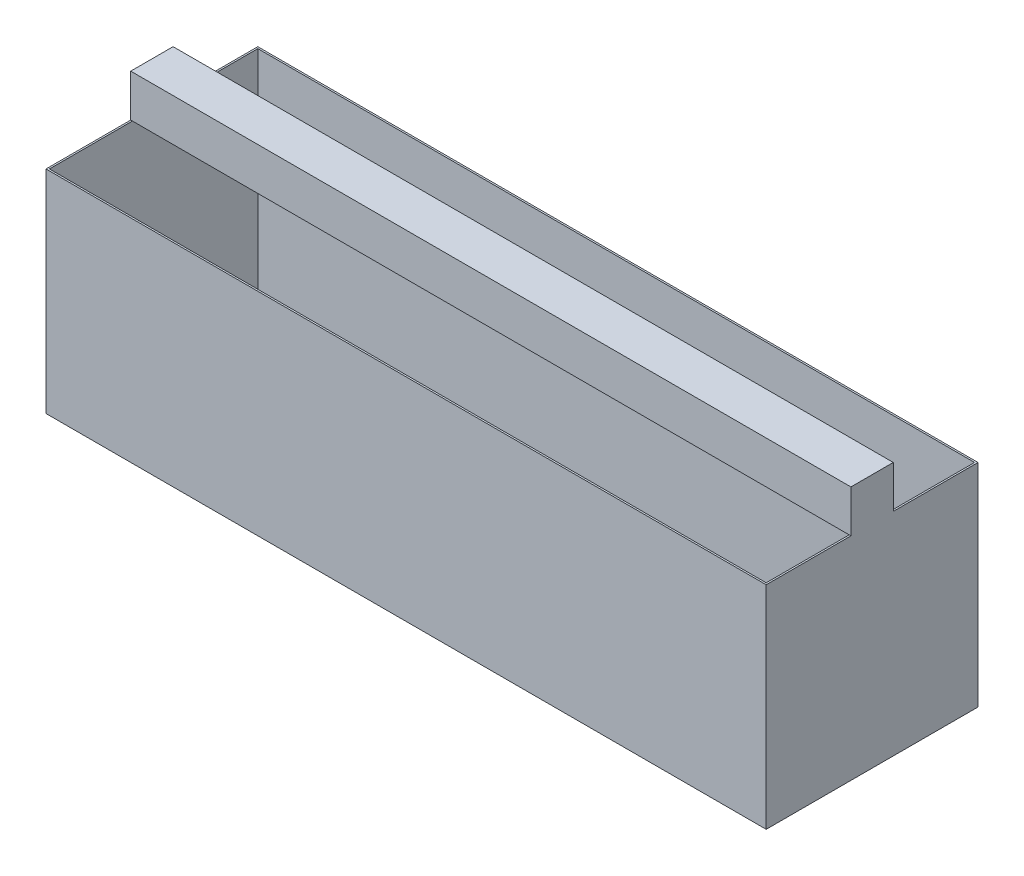
ISO-10303-21;
HEADER;
FILE_DESCRIPTION(('STEP AP214'),'2;1');
FILE_NAME('part.step','',(''),(''),'','','');
FILE_SCHEMA(('AUTOMOTIVE_DESIGN { 1 0 10303 214 1 1 1 1 }'));
ENDSEC;
DATA;
#1=APPLICATION_CONTEXT('core data for automotive mechanical design processes');
#2=APPLICATION_PROTOCOL_DEFINITION('international standard','automotive_design',2000,#1);
#3=PRODUCT_CONTEXT('',#1,'mechanical');
#4=PRODUCT('Part','Part','',(#3));
#5=PRODUCT_RELATED_PRODUCT_CATEGORY('part','',(#4));
#6=PRODUCT_DEFINITION_FORMATION('','',#4);
#7=PRODUCT_DEFINITION_CONTEXT('part definition',#1,'design');
#8=PRODUCT_DEFINITION('design','',#6,#7);
#9=PRODUCT_DEFINITION_SHAPE('','',#8);
#10=(LENGTH_UNIT() NAMED_UNIT(*) SI_UNIT(.MILLI.,.METRE.));
#11=(NAMED_UNIT(*) PLANE_ANGLE_UNIT() SI_UNIT($,.RADIAN.));
#12=(NAMED_UNIT(*) SI_UNIT($,.STERADIAN.) SOLID_ANGLE_UNIT());
#13=UNCERTAINTY_MEASURE_WITH_UNIT(LENGTH_MEASURE(1.E-05),#10,'distance_accuracy_value','');
#14=(GEOMETRIC_REPRESENTATION_CONTEXT(3) GLOBAL_UNCERTAINTY_ASSIGNED_CONTEXT((#13)) GLOBAL_UNIT_ASSIGNED_CONTEXT((#10,
#11,#12)) REPRESENTATION_CONTEXT('',''));
#15=CARTESIAN_POINT('',(0.,0.,0.));
#16=DIRECTION('',(0.,0.,1.));
#17=DIRECTION('',(1.,0.,0.));
#18=AXIS2_PLACEMENT_3D('',#15,#16,#17);
#19=CARTESIAN_POINT('',(0.,500.,500.));
#20=DIRECTION('',(0.,1.,0.));
#21=DIRECTION('',(0.,0.,1.));
#22=AXIS2_PLACEMENT_3D('',#19,#20,#21);
#23=PLANE('',#22);
#24=DIRECTION('',(0.,0.,-1.));
#25=VECTOR('',#24,1.);
#26=CARTESIAN_POINT('',(0.,500.,500.));
#27=LINE('',#26,#25);
#28=CARTESIAN_POINT('',(0.,500.,200.));
#29=VERTEX_POINT('',#28);
#30=CARTESIAN_POINT('',(0.,500.,0.));
#31=VERTEX_POINT('',#30);
#32=EDGE_CURVE('E146',#29,#31,#27,.T.);
#33=ORIENTED_EDGE('',*,*,#32,.F.);
#34=DIRECTION('',(1.,0.,0.));
#35=VECTOR('',#34,1.);
#36=CARTESIAN_POINT('',(-141.42135623731,500.,200.));
#37=LINE('',#36,#35);
#38=CARTESIAN_POINT('',(4.,500.,200.));
#39=VERTEX_POINT('',#38);
#40=EDGE_CURVE('E155',#29,#39,#37,.T.);
#41=ORIENTED_EDGE('',*,*,#40,.T.);
#42=DIRECTION('',(0.,0.,-1.));
#43=VECTOR('',#42,1.);
#44=CARTESIAN_POINT('',(4.,500.,500.));
#45=LINE('',#44,#43);
#46=CARTESIAN_POINT('',(4.,500.,4.));
#47=VERTEX_POINT('',#46);
#48=EDGE_CURVE('E251',#39,#47,#45,.T.);
#49=ORIENTED_EDGE('',*,*,#48,.T.);
#50=DIRECTION('',(1.,0.,0.));
#51=VECTOR('',#50,1.);
#52=CARTESIAN_POINT('',(0.,500.,4.));
#53=LINE('',#52,#51);
#54=CARTESIAN_POINT('',(1696.,500.,4.));
#55=VERTEX_POINT('',#54);
#56=EDGE_CURVE('E228',#47,#55,#53,.T.);
#57=ORIENTED_EDGE('',*,*,#56,.T.);
#58=DIRECTION('',(0.,0.,-1.));
#59=VECTOR('',#58,1.);
#60=CARTESIAN_POINT('',(1696.,500.,500.));
#61=LINE('',#60,#59);
#62=CARTESIAN_POINT('',(1696.,500.,200.));
#63=VERTEX_POINT('',#62);
#64=EDGE_CURVE('E240',#63,#55,#61,.T.);
#65=ORIENTED_EDGE('',*,*,#64,.F.);
#66=CARTESIAN_POINT('',(1700.,500.,200.));
#67=VERTEX_POINT('',#66);
#68=EDGE_CURVE('E49',#63,#67,#37,.T.);
#69=ORIENTED_EDGE('',*,*,#68,.T.);
#70=DIRECTION('',(0.,0.,-1.));
#71=VECTOR('',#70,1.);
#72=CARTESIAN_POINT('',(1700.,500.,500.));
#73=LINE('',#72,#71);
#74=CARTESIAN_POINT('',(1700.,500.,0.));
#75=VERTEX_POINT('',#74);
#76=EDGE_CURVE('E170',#67,#75,#73,.T.);
#77=ORIENTED_EDGE('',*,*,#76,.T.);
#78=DIRECTION('',(1.,0.,0.));
#79=VECTOR('',#78,1.);
#80=CARTESIAN_POINT('',(0.,500.,0.));
#81=LINE('',#80,#79);
#82=EDGE_CURVE('E163',#31,#75,#81,.T.);
#83=ORIENTED_EDGE('',*,*,#82,.F.);
#84=EDGE_LOOP('',(#33,#41,#49,#57,#65,#69,#77,#83));
#85=FACE_BOUND('',#84,.T.);
#86=ADVANCED_FACE('F39',(#85),#23,.T.);
#87=DIRECTION('',(1.,0.,0.));
#88=VECTOR('',#87,1.);
#89=CARTESIAN_POINT('',(-141.42135623731,500.,300.));
#90=LINE('',#89,#88);
#91=CARTESIAN_POINT('',(0.,500.,300.));
#92=VERTEX_POINT('',#91);
#93=CARTESIAN_POINT('',(4.,500.,300.));
#94=VERTEX_POINT('',#93);
#95=EDGE_CURVE('E51',#92,#94,#90,.T.);
#96=ORIENTED_EDGE('',*,*,#95,.F.);
#97=CARTESIAN_POINT('',(0.,500.,500.));
#98=VERTEX_POINT('',#97);
#99=EDGE_CURVE('E43',#98,#92,#27,.T.);
#100=ORIENTED_EDGE('',*,*,#99,.F.);
#101=DIRECTION('',(1.,0.,0.));
#102=VECTOR('',#101,1.);
#103=CARTESIAN_POINT('',(0.,500.,500.));
#104=LINE('',#103,#102);
#105=CARTESIAN_POINT('',(1700.,500.,500.));
#106=VERTEX_POINT('',#105);
#107=EDGE_CURVE('E178',#98,#106,#104,.T.);
#108=ORIENTED_EDGE('',*,*,#107,.T.);
#109=CARTESIAN_POINT('',(1700.,500.,300.));
#110=VERTEX_POINT('',#109);
#111=EDGE_CURVE('E202',#106,#110,#73,.T.);
#112=ORIENTED_EDGE('',*,*,#111,.T.);
#113=CARTESIAN_POINT('',(1696.,500.,300.));
#114=VERTEX_POINT('',#113);
#115=EDGE_CURVE('E11',#114,#110,#90,.T.);
#116=ORIENTED_EDGE('',*,*,#115,.F.);
#117=CARTESIAN_POINT('',(1696.,500.,496.));
#118=VERTEX_POINT('',#117);
#119=EDGE_CURVE('E234',#118,#114,#61,.T.);
#120=ORIENTED_EDGE('',*,*,#119,.F.);
#121=DIRECTION('',(1.,0.,0.));
#122=VECTOR('',#121,1.);
#123=CARTESIAN_POINT('',(0.,500.,496.));
#124=LINE('',#123,#122);
#125=CARTESIAN_POINT('',(4.,500.,496.));
#126=VERTEX_POINT('',#125);
#127=EDGE_CURVE('E241',#126,#118,#124,.T.);
#128=ORIENTED_EDGE('',*,*,#127,.F.);
#129=EDGE_CURVE('E246',#126,#94,#45,.T.);
#130=ORIENTED_EDGE('',*,*,#129,.T.);
#131=EDGE_LOOP('',(#96,#100,#108,#112,#116,#120,#128,#130));
#132=FACE_BOUND('',#131,.T.);
#133=ADVANCED_FACE('F305',(#132),#23,.T.);
#134=CARTESIAN_POINT('',(0.,0.,500.));
#135=DIRECTION('',(-1.,0.,0.));
#136=DIRECTION('',(0.,0.,1.));
#137=AXIS2_PLACEMENT_3D('',#134,#135,#136);
#138=PLANE('',#137);
#139=DIRECTION('',(0.,1.,0.));
#140=VECTOR('',#139,1.);
#141=CARTESIAN_POINT('',(0.,0.,0.));
#142=LINE('',#141,#140);
#143=CARTESIAN_POINT('',(0.,0.,0.));
#144=VERTEX_POINT('',#143);
#145=EDGE_CURVE('E182',#144,#31,#142,.T.);
#146=ORIENTED_EDGE('',*,*,#145,.F.);
#147=DIRECTION('',(0.,0.,-1.));
#148=VECTOR('',#147,1.);
#149=CARTESIAN_POINT('',(0.,0.,500.));
#150=LINE('',#149,#148);
#151=CARTESIAN_POINT('',(0.,0.,500.));
#152=VERTEX_POINT('',#151);
#153=EDGE_CURVE('E196',#152,#144,#150,.T.);
#154=ORIENTED_EDGE('',*,*,#153,.F.);
#155=DIRECTION('',(0.,1.,0.));
#156=VECTOR('',#155,1.);
#157=CARTESIAN_POINT('',(0.,0.,500.));
#158=LINE('',#157,#156);
#159=EDGE_CURVE('E195',#152,#98,#158,.T.);
#160=ORIENTED_EDGE('',*,*,#159,.T.);
#161=ORIENTED_EDGE('',*,*,#99,.T.);
#162=DIRECTION('',(0.,-1.,0.));
#163=VECTOR('',#162,1.);
#164=CARTESIAN_POINT('',(0.,600.,300.));
#165=LINE('',#164,#163);
#166=CARTESIAN_POINT('',(0.,600.,300.));
#167=VERTEX_POINT('',#166);
#168=EDGE_CURVE('E285',#167,#92,#165,.T.);
#169=ORIENTED_EDGE('',*,*,#168,.F.);
#170=DIRECTION('',(0.,0.,-1.));
#171=VECTOR('',#170,1.);
#172=CARTESIAN_POINT('',(0.,600.,300.));
#173=LINE('',#172,#171);
#174=CARTESIAN_POINT('',(0.,600.,200.));
#175=VERTEX_POINT('',#174);
#176=EDGE_CURVE('E149',#167,#175,#173,.T.);
#177=ORIENTED_EDGE('',*,*,#176,.T.);
#178=DIRECTION('',(0.,-1.,0.));
#179=VECTOR('',#178,1.);
#180=CARTESIAN_POINT('',(0.,600.,200.));
#181=LINE('',#180,#179);
#182=EDGE_CURVE('E143',#175,#29,#181,.T.);
#183=ORIENTED_EDGE('',*,*,#182,.T.);
#184=ORIENTED_EDGE('',*,*,#32,.T.);
#185=EDGE_LOOP('',(#146,#154,#160,#161,#169,#177,#183,#184));
#186=FACE_BOUND('',#185,.T.);
#187=ADVANCED_FACE('F41',(#186),#138,.T.);
#188=CARTESIAN_POINT('',(0.,0.,500.));
#189=DIRECTION('',(0.,1.,0.));
#190=DIRECTION('',(0.,0.,1.));
#191=AXIS2_PLACEMENT_3D('',#188,#189,#190);
#192=PLANE('',#191);
#193=DIRECTION('',(1.,0.,0.));
#194=VECTOR('',#193,1.);
#195=CARTESIAN_POINT('',(0.,0.,0.));
#196=LINE('',#195,#194);
#197=CARTESIAN_POINT('',(1700.,0.,0.));
#198=VERTEX_POINT('',#197);
#199=EDGE_CURVE('E192',#144,#198,#196,.T.);
#200=ORIENTED_EDGE('',*,*,#199,.T.);
#201=DIRECTION('',(0.,0.,-1.));
#202=VECTOR('',#201,1.);
#203=CARTESIAN_POINT('',(1700.,0.,500.));
#204=LINE('',#203,#202);
#205=CARTESIAN_POINT('',(1700.,0.,500.));
#206=VERTEX_POINT('',#205);
#207=EDGE_CURVE('E199',#206,#198,#204,.T.);
#208=ORIENTED_EDGE('',*,*,#207,.F.);
#209=DIRECTION('',(1.,0.,0.));
#210=VECTOR('',#209,1.);
#211=CARTESIAN_POINT('',(0.,0.,500.));
#212=LINE('',#211,#210);
#213=EDGE_CURVE('E166',#152,#206,#212,.T.);
#214=ORIENTED_EDGE('',*,*,#213,.F.);
#215=ORIENTED_EDGE('',*,*,#153,.T.);
#216=EDGE_LOOP('',(#200,#208,#214,#215));
#217=FACE_BOUND('',#216,.T.);
#218=ADVANCED_FACE('F221',(#217),#192,.F.);
#219=CARTESIAN_POINT('',(1700.,0.,500.));
#220=DIRECTION('',(-1.,0.,0.));
#221=DIRECTION('',(0.,0.,1.));
#222=AXIS2_PLACEMENT_3D('',#219,#220,#221);
#223=PLANE('',#222);
#224=DIRECTION('',(0.,1.,0.));
#225=VECTOR('',#224,1.);
#226=CARTESIAN_POINT('',(1700.,0.,0.));
#227=LINE('',#226,#225);
#228=EDGE_CURVE('E188',#198,#75,#227,.T.);
#229=ORIENTED_EDGE('',*,*,#228,.T.);
#230=ORIENTED_EDGE('',*,*,#76,.F.);
#231=DIRECTION('',(0.,-1.,0.));
#232=VECTOR('',#231,1.);
#233=CARTESIAN_POINT('',(1700.,600.,200.));
#234=LINE('',#233,#232);
#235=CARTESIAN_POINT('',(1700.,600.,200.));
#236=VERTEX_POINT('',#235);
#237=EDGE_CURVE('E65',#236,#67,#234,.T.);
#238=ORIENTED_EDGE('',*,*,#237,.F.);
#239=DIRECTION('',(0.,0.,-1.));
#240=VECTOR('',#239,1.);
#241=CARTESIAN_POINT('',(1700.,600.,300.));
#242=LINE('',#241,#240);
#243=CARTESIAN_POINT('',(1700.,600.,300.));
#244=VERTEX_POINT('',#243);
#245=EDGE_CURVE('E281',#244,#236,#242,.T.);
#246=ORIENTED_EDGE('',*,*,#245,.F.);
#247=DIRECTION('',(0.,-1.,0.));
#248=VECTOR('',#247,1.);
#249=CARTESIAN_POINT('',(1700.,600.,300.));
#250=LINE('',#249,#248);
#251=EDGE_CURVE('E152',#244,#110,#250,.T.);
#252=ORIENTED_EDGE('',*,*,#251,.T.);
#253=ORIENTED_EDGE('',*,*,#111,.F.);
#254=DIRECTION('',(0.,1.,0.));
#255=VECTOR('',#254,1.);
#256=CARTESIAN_POINT('',(1700.,0.,500.));
#257=LINE('',#256,#255);
#258=EDGE_CURVE('E171',#206,#106,#257,.T.);
#259=ORIENTED_EDGE('',*,*,#258,.F.);
#260=ORIENTED_EDGE('',*,*,#207,.T.);
#261=EDGE_LOOP('',(#229,#230,#238,#246,#252,#253,#259,#260));
#262=FACE_BOUND('',#261,.T.);
#263=ADVANCED_FACE('F214',(#262),#223,.F.);
#264=CARTESIAN_POINT('',(0.,0.,500.));
#265=DIRECTION('',(0.,0.,-1.));
#266=DIRECTION('',(-1.,0.,0.));
#267=AXIS2_PLACEMENT_3D('',#264,#265,#266);
#268=PLANE('',#267);
#269=ORIENTED_EDGE('',*,*,#159,.F.);
#270=ORIENTED_EDGE('',*,*,#213,.T.);
#271=ORIENTED_EDGE('',*,*,#258,.T.);
#272=ORIENTED_EDGE('',*,*,#107,.F.);
#273=EDGE_LOOP('',(#269,#270,#271,#272));
#274=FACE_BOUND('',#273,.T.);
#275=ADVANCED_FACE('F223',(#274),#268,.F.);
#276=CARTESIAN_POINT('',(0.,0.,0.));
#277=DIRECTION('',(0.,0.,-1.));
#278=DIRECTION('',(-1.,0.,0.));
#279=AXIS2_PLACEMENT_3D('',#276,#277,#278);
#280=PLANE('',#279);
#281=ORIENTED_EDGE('',*,*,#145,.T.);
#282=ORIENTED_EDGE('',*,*,#82,.T.);
#283=ORIENTED_EDGE('',*,*,#228,.F.);
#284=ORIENTED_EDGE('',*,*,#199,.F.);
#285=EDGE_LOOP('',(#281,#282,#283,#284));
#286=FACE_BOUND('',#285,.T.);
#287=ADVANCED_FACE('F218',(#286),#280,.T.);
#288=CARTESIAN_POINT('',(4.,0.,500.));
#289=DIRECTION('',(-1.,0.,0.));
#290=DIRECTION('',(0.,0.,1.));
#291=AXIS2_PLACEMENT_3D('',#288,#289,#290);
#292=PLANE('',#291);
#293=DIRECTION('',(0.,1.,0.));
#294=VECTOR('',#293,1.);
#295=CARTESIAN_POINT('',(4.,0.,4.));
#296=LINE('',#295,#294);
#297=CARTESIAN_POINT('',(4.,4.,4.));
#298=VERTEX_POINT('',#297);
#299=EDGE_CURVE('E233',#298,#47,#296,.T.);
#300=ORIENTED_EDGE('',*,*,#299,.T.);
#301=ORIENTED_EDGE('',*,*,#48,.F.);
#302=EDGE_CURVE('E250',#94,#39,#45,.T.);
#303=ORIENTED_EDGE('',*,*,#302,.F.);
#304=ORIENTED_EDGE('',*,*,#129,.F.);
#305=DIRECTION('',(0.,1.,0.));
#306=VECTOR('',#305,1.);
#307=CARTESIAN_POINT('',(4.,0.,496.));
#308=LINE('',#307,#306);
#309=CARTESIAN_POINT('',(4.,4.,496.));
#310=VERTEX_POINT('',#309);
#311=EDGE_CURVE('E245',#310,#126,#308,.T.);
#312=ORIENTED_EDGE('',*,*,#311,.F.);
#313=DIRECTION('',(0.,0.,-1.));
#314=VECTOR('',#313,1.);
#315=CARTESIAN_POINT('',(4.,4.,500.));
#316=LINE('',#315,#314);
#317=EDGE_CURVE('E185',#310,#298,#316,.T.);
#318=ORIENTED_EDGE('',*,*,#317,.T.);
#319=EDGE_LOOP('',(#300,#301,#303,#304,#312,#318));
#320=FACE_BOUND('',#319,.T.);
#321=ADVANCED_FACE('F319',(#320),#292,.F.);
#322=CARTESIAN_POINT('',(0.,4.,500.));
#323=DIRECTION('',(0.,1.,0.));
#324=DIRECTION('',(0.,0.,1.));
#325=AXIS2_PLACEMENT_3D('',#322,#323,#324);
#326=PLANE('',#325);
#327=DIRECTION('',(1.,0.,0.));
#328=VECTOR('',#327,1.);
#329=CARTESIAN_POINT('',(0.,4.,4.));
#330=LINE('',#329,#328);
#331=CARTESIAN_POINT('',(1696.,4.,4.));
#332=VERTEX_POINT('',#331);
#333=EDGE_CURVE('E259',#298,#332,#330,.T.);
#334=ORIENTED_EDGE('',*,*,#333,.F.);
#335=ORIENTED_EDGE('',*,*,#317,.F.);
#336=DIRECTION('',(1.,0.,0.));
#337=VECTOR('',#336,1.);
#338=CARTESIAN_POINT('',(0.,4.,496.));
#339=LINE('',#338,#337);
#340=CARTESIAN_POINT('',(1696.,4.,496.));
#341=VERTEX_POINT('',#340);
#342=EDGE_CURVE('E255',#310,#341,#339,.T.);
#343=ORIENTED_EDGE('',*,*,#342,.T.);
#344=DIRECTION('',(0.,0.,-1.));
#345=VECTOR('',#344,1.);
#346=CARTESIAN_POINT('',(1696.,4.,500.));
#347=LINE('',#346,#345);
#348=EDGE_CURVE('E238',#341,#332,#347,.T.);
#349=ORIENTED_EDGE('',*,*,#348,.T.);
#350=EDGE_LOOP('',(#334,#335,#343,#349));
#351=FACE_BOUND('',#350,.T.);
#352=ADVANCED_FACE('F329',(#351),#326,.T.);
#353=CARTESIAN_POINT('',(1696.,0.,500.));
#354=DIRECTION('',(-1.,0.,0.));
#355=DIRECTION('',(0.,0.,1.));
#356=AXIS2_PLACEMENT_3D('',#353,#354,#355);
#357=PLANE('',#356);
#358=DIRECTION('',(0.,1.,0.));
#359=VECTOR('',#358,1.);
#360=CARTESIAN_POINT('',(1696.,0.,4.));
#361=LINE('',#360,#359);
#362=EDGE_CURVE('E232',#332,#55,#361,.T.);
#363=ORIENTED_EDGE('',*,*,#362,.F.);
#364=ORIENTED_EDGE('',*,*,#348,.F.);
#365=DIRECTION('',(0.,1.,0.));
#366=VECTOR('',#365,1.);
#367=CARTESIAN_POINT('',(1696.,0.,496.));
#368=LINE('',#367,#366);
#369=EDGE_CURVE('E244',#341,#118,#368,.T.);
#370=ORIENTED_EDGE('',*,*,#369,.T.);
#371=ORIENTED_EDGE('',*,*,#119,.T.);
#372=EDGE_CURVE('E239',#114,#63,#61,.T.);
#373=ORIENTED_EDGE('',*,*,#372,.T.);
#374=ORIENTED_EDGE('',*,*,#64,.T.);
#375=EDGE_LOOP('',(#363,#364,#370,#371,#373,#374));
#376=FACE_BOUND('',#375,.T.);
#377=ADVANCED_FACE('F310',(#376),#357,.T.);
#378=CARTESIAN_POINT('',(0.,0.,496.));
#379=DIRECTION('',(0.,0.,-1.));
#380=DIRECTION('',(-1.,0.,0.));
#381=AXIS2_PLACEMENT_3D('',#378,#379,#380);
#382=PLANE('',#381);
#383=ORIENTED_EDGE('',*,*,#311,.T.);
#384=ORIENTED_EDGE('',*,*,#127,.T.);
#385=ORIENTED_EDGE('',*,*,#369,.F.);
#386=ORIENTED_EDGE('',*,*,#342,.F.);
#387=EDGE_LOOP('',(#383,#384,#385,#386));
#388=FACE_BOUND('',#387,.T.);
#389=ADVANCED_FACE('F315',(#388),#382,.T.);
#390=CARTESIAN_POINT('',(0.,0.,4.));
#391=DIRECTION('',(0.,0.,-1.));
#392=DIRECTION('',(-1.,0.,0.));
#393=AXIS2_PLACEMENT_3D('',#390,#391,#392);
#394=PLANE('',#393);
#395=ORIENTED_EDGE('',*,*,#299,.F.);
#396=ORIENTED_EDGE('',*,*,#333,.T.);
#397=ORIENTED_EDGE('',*,*,#362,.T.);
#398=ORIENTED_EDGE('',*,*,#56,.F.);
#399=EDGE_LOOP('',(#395,#396,#397,#398));
#400=FACE_BOUND('',#399,.T.);
#401=ADVANCED_FACE('F326',(#400),#394,.F.);
#402=CARTESIAN_POINT('',(-141.42135623731,500.,300.));
#403=DIRECTION('',(0.,-1.,0.));
#404=DIRECTION('',(0.,0.,-1.));
#405=AXIS2_PLACEMENT_3D('',#402,#403,#404);
#406=PLANE('',#405);
#407=EDGE_CURVE('E52',#94,#114,#90,.T.);
#408=ORIENTED_EDGE('',*,*,#407,.F.);
#409=ORIENTED_EDGE('',*,*,#302,.T.);
#410=EDGE_CURVE('E59',#39,#63,#37,.T.);
#411=ORIENTED_EDGE('',*,*,#410,.T.);
#412=ORIENTED_EDGE('',*,*,#372,.F.);
#413=EDGE_LOOP('',(#408,#409,#411,#412));
#414=FACE_BOUND('',#413,.T.);
#415=ADVANCED_FACE('F355',(#414),#406,.T.);
#416=CARTESIAN_POINT('',(-141.42135623731,600.,200.));
#417=DIRECTION('',(0.,0.,1.));
#418=DIRECTION('',(0.,-1.,0.));
#419=AXIS2_PLACEMENT_3D('',#416,#417,#418);
#420=PLANE('',#419);
#421=ORIENTED_EDGE('',*,*,#182,.F.);
#422=DIRECTION('',(1.,0.,0.));
#423=VECTOR('',#422,1.);
#424=CARTESIAN_POINT('',(-141.42135623731,600.,200.));
#425=LINE('',#424,#423);
#426=EDGE_CURVE('E160',#175,#236,#425,.T.);
#427=ORIENTED_EDGE('',*,*,#426,.T.);
#428=ORIENTED_EDGE('',*,*,#237,.T.);
#429=ORIENTED_EDGE('',*,*,#68,.F.);
#430=ORIENTED_EDGE('',*,*,#410,.F.);
#431=ORIENTED_EDGE('',*,*,#40,.F.);
#432=EDGE_LOOP('',(#421,#427,#428,#429,#430,#431));
#433=FACE_BOUND('',#432,.T.);
#434=ADVANCED_FACE('F156',(#433),#420,.F.);
#435=CARTESIAN_POINT('',(-141.42135623731,600.,300.));
#436=DIRECTION('',(0.,-1.,0.));
#437=DIRECTION('',(0.,0.,-1.));
#438=AXIS2_PLACEMENT_3D('',#435,#436,#437);
#439=PLANE('',#438);
#440=ORIENTED_EDGE('',*,*,#176,.F.);
#441=DIRECTION('',(1.,0.,0.));
#442=VECTOR('',#441,1.);
#443=CARTESIAN_POINT('',(-141.42135623731,600.,300.));
#444=LINE('',#443,#442);
#445=EDGE_CURVE('E279',#167,#244,#444,.T.);
#446=ORIENTED_EDGE('',*,*,#445,.T.);
#447=ORIENTED_EDGE('',*,*,#245,.T.);
#448=ORIENTED_EDGE('',*,*,#426,.F.);
#449=EDGE_LOOP('',(#440,#446,#447,#448));
#450=FACE_BOUND('',#449,.T.);
#451=ADVANCED_FACE('F297',(#450),#439,.F.);
#452=CARTESIAN_POINT('',(-141.42135623731,600.,300.));
#453=DIRECTION('',(0.,0.,1.));
#454=DIRECTION('',(0.,-1.,0.));
#455=AXIS2_PLACEMENT_3D('',#452,#453,#454);
#456=PLANE('',#455);
#457=ORIENTED_EDGE('',*,*,#445,.F.);
#458=ORIENTED_EDGE('',*,*,#168,.T.);
#459=ORIENTED_EDGE('',*,*,#95,.T.);
#460=ORIENTED_EDGE('',*,*,#407,.T.);
#461=ORIENTED_EDGE('',*,*,#115,.T.);
#462=ORIENTED_EDGE('',*,*,#251,.F.);
#463=EDGE_LOOP('',(#457,#458,#459,#460,#461,#462));
#464=FACE_BOUND('',#463,.T.);
#465=ADVANCED_FACE('F301',(#464),#456,.T.);
#466=CLOSED_SHELL('',(#86,#133,#187,#218,#263,#275,#287,#321,#352,#377,#389,#401,#415,#434,#451,#465));
#467=MANIFOLD_SOLID_BREP('B2',#466);
#468=ADVANCED_BREP_SHAPE_REPRESENTATION('',(#18,#467),#14);
#469=SHAPE_DEFINITION_REPRESENTATION(#9,#468);
ENDSEC;
END-ISO-10303-21;
